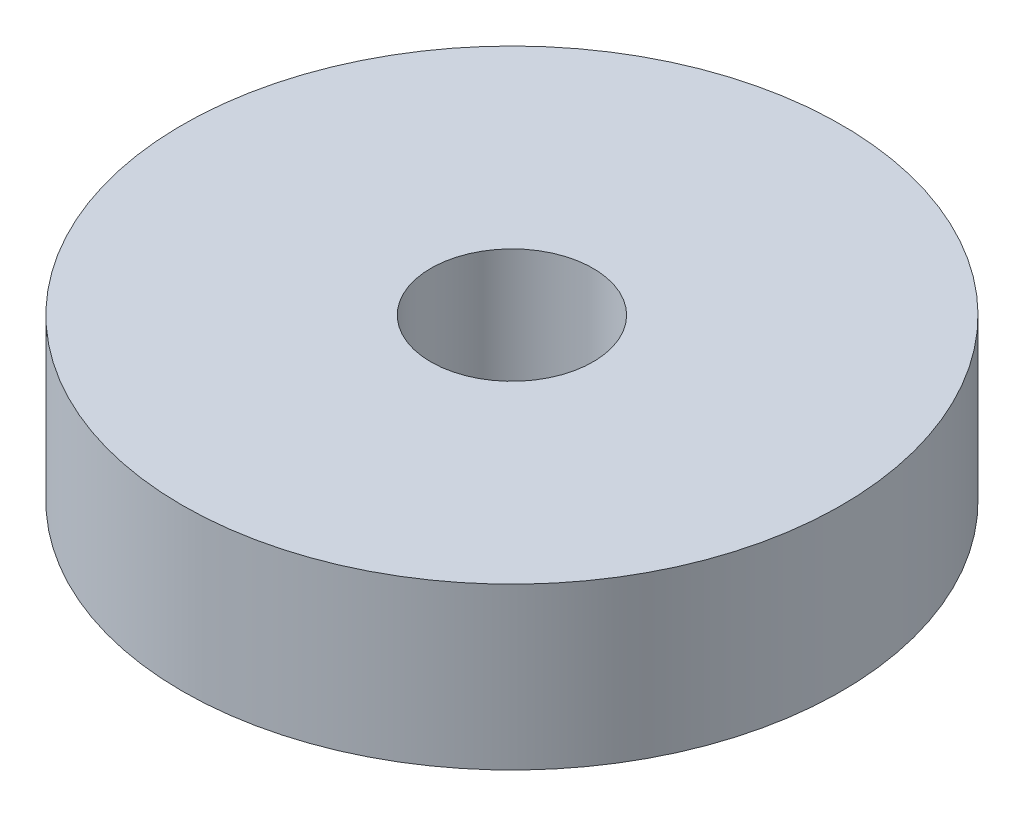
ISO-10303-21;
HEADER;
FILE_DESCRIPTION(('STEP AP214'),'2;1');
FILE_NAME('part.step','',(''),(''),'','','');
FILE_SCHEMA(('AUTOMOTIVE_DESIGN { 1 0 10303 214 1 1 1 1 }'));
ENDSEC;
DATA;
#1=APPLICATION_CONTEXT('core data for automotive mechanical design processes');
#2=APPLICATION_PROTOCOL_DEFINITION('international standard','automotive_design',2000,#1);
#3=PRODUCT_CONTEXT('',#1,'mechanical');
#4=PRODUCT('Part','Part','',(#3));
#5=PRODUCT_RELATED_PRODUCT_CATEGORY('part','',(#4));
#6=PRODUCT_DEFINITION_FORMATION('','',#4);
#7=PRODUCT_DEFINITION_CONTEXT('part definition',#1,'design');
#8=PRODUCT_DEFINITION('design','',#6,#7);
#9=PRODUCT_DEFINITION_SHAPE('','',#8);
#10=(LENGTH_UNIT() NAMED_UNIT(*) SI_UNIT(.MILLI.,.METRE.));
#11=(NAMED_UNIT(*) PLANE_ANGLE_UNIT() SI_UNIT($,.RADIAN.));
#12=(NAMED_UNIT(*) SI_UNIT($,.STERADIAN.) SOLID_ANGLE_UNIT());
#13=UNCERTAINTY_MEASURE_WITH_UNIT(LENGTH_MEASURE(1.E-05),#10,'distance_accuracy_value','');
#14=(GEOMETRIC_REPRESENTATION_CONTEXT(3) GLOBAL_UNCERTAINTY_ASSIGNED_CONTEXT((#13)) GLOBAL_UNIT_ASSIGNED_CONTEXT((#10,
#11,#12)) REPRESENTATION_CONTEXT('',''));
#15=CARTESIAN_POINT('',(0.,0.,0.));
#16=DIRECTION('',(0.,0.,1.));
#17=DIRECTION('',(1.,0.,0.));
#18=AXIS2_PLACEMENT_3D('',#15,#16,#17);
#19=CARTESIAN_POINT('',(0.,1.5875,0.));
#20=DIRECTION('',(0.,1.,0.));
#21=DIRECTION('',(0.,0.,1.));
#22=AXIS2_PLACEMENT_3D('',#19,#20,#21);
#23=PLANE('',#22);
#24=CARTESIAN_POINT('',(0.,1.5875,0.));
#25=DIRECTION('',(0.,1.,0.));
#26=DIRECTION('',(0.,0.,1.));
#27=AXIS2_PLACEMENT_3D('',#24,#25,#26);
#28=CIRCLE('',#27,6.5);
#29=CARTESIAN_POINT('',(0.,1.5875,6.5));
#30=VERTEX_POINT('',#29);
#31=EDGE_CURVE('E10',#30,#30,#28,.T.);
#32=ORIENTED_EDGE('',*,*,#31,.T.);
#33=EDGE_LOOP('',(#32));
#34=FACE_BOUND('',#33,.T.);
#35=CARTESIAN_POINT('',(0.,1.5875,0.));
#36=DIRECTION('',(0.,1.,0.));
#37=DIRECTION('',(0.,0.,1.));
#38=AXIS2_PLACEMENT_3D('',#35,#36,#37);
#39=CIRCLE('',#38,1.6);
#40=CARTESIAN_POINT('',(0.,1.5875,1.6));
#41=VERTEX_POINT('',#40);
#42=EDGE_CURVE('E48',#41,#41,#39,.T.);
#43=ORIENTED_EDGE('',*,*,#42,.F.);
#44=EDGE_LOOP('',(#43));
#45=FACE_BOUND('',#44,.T.);
#46=ADVANCED_FACE('F37',(#34,#45),#23,.T.);
#47=CARTESIAN_POINT('',(0.,-1.5875,0.));
#48=DIRECTION('',(0.,1.,0.));
#49=DIRECTION('',(0.,0.,1.));
#50=AXIS2_PLACEMENT_3D('',#47,#48,#49);
#51=PLANE('',#50);
#52=CARTESIAN_POINT('',(0.,-1.5875,0.));
#53=DIRECTION('',(0.,1.,0.));
#54=DIRECTION('',(0.,0.,1.));
#55=AXIS2_PLACEMENT_3D('',#52,#53,#54);
#56=CIRCLE('',#55,6.5);
#57=CARTESIAN_POINT('',(0.,-1.5875,6.5));
#58=VERTEX_POINT('',#57);
#59=EDGE_CURVE('E41',#58,#58,#56,.T.);
#60=ORIENTED_EDGE('',*,*,#59,.F.);
#61=EDGE_LOOP('',(#60));
#62=FACE_BOUND('',#61,.T.);
#63=CARTESIAN_POINT('',(0.,-1.5875,0.));
#64=DIRECTION('',(0.,1.,0.));
#65=DIRECTION('',(0.,0.,1.));
#66=AXIS2_PLACEMENT_3D('',#63,#64,#65);
#67=CIRCLE('',#66,1.6);
#68=CARTESIAN_POINT('',(0.,-1.5875,1.6));
#69=VERTEX_POINT('',#68);
#70=EDGE_CURVE('E50',#69,#69,#67,.T.);
#71=ORIENTED_EDGE('',*,*,#70,.T.);
#72=EDGE_LOOP('',(#71));
#73=FACE_BOUND('',#72,.T.);
#74=ADVANCED_FACE('F60',(#62,#73),#51,.F.);
#75=CARTESIAN_POINT('',(0.,1.5875,0.));
#76=DIRECTION('',(0.,-1.,0.));
#77=DIRECTION('',(0.,0.,-1.));
#78=AXIS2_PLACEMENT_3D('',#75,#76,#77);
#79=CYLINDRICAL_SURFACE('',#78,6.5);
#80=ORIENTED_EDGE('',*,*,#31,.F.);
#81=EDGE_LOOP('',(#80));
#82=FACE_BOUND('',#81,.T.);
#83=ORIENTED_EDGE('',*,*,#59,.T.);
#84=EDGE_LOOP('',(#83));
#85=FACE_BOUND('',#84,.T.);
#86=ADVANCED_FACE('F39',(#82,#85),#79,.T.);
#87=CARTESIAN_POINT('',(0.,1.5875,0.));
#88=DIRECTION('',(0.,-1.,0.));
#89=DIRECTION('',(0.,0.,-1.));
#90=AXIS2_PLACEMENT_3D('',#87,#88,#89);
#91=CYLINDRICAL_SURFACE('',#90,1.6);
#92=ORIENTED_EDGE('',*,*,#42,.T.);
#93=EDGE_LOOP('',(#92));
#94=FACE_BOUND('',#93,.T.);
#95=ORIENTED_EDGE('',*,*,#70,.F.);
#96=EDGE_LOOP('',(#95));
#97=FACE_BOUND('',#96,.T.);
#98=ADVANCED_FACE('F56',(#94,#97),#91,.F.);
#99=CLOSED_SHELL('',(#46,#74,#86,#98));
#100=MANIFOLD_SOLID_BREP('B2',#99);
#101=ADVANCED_BREP_SHAPE_REPRESENTATION('',(#18,#100),#14);
#102=SHAPE_DEFINITION_REPRESENTATION(#9,#101);
ENDSEC;
END-ISO-10303-21;
